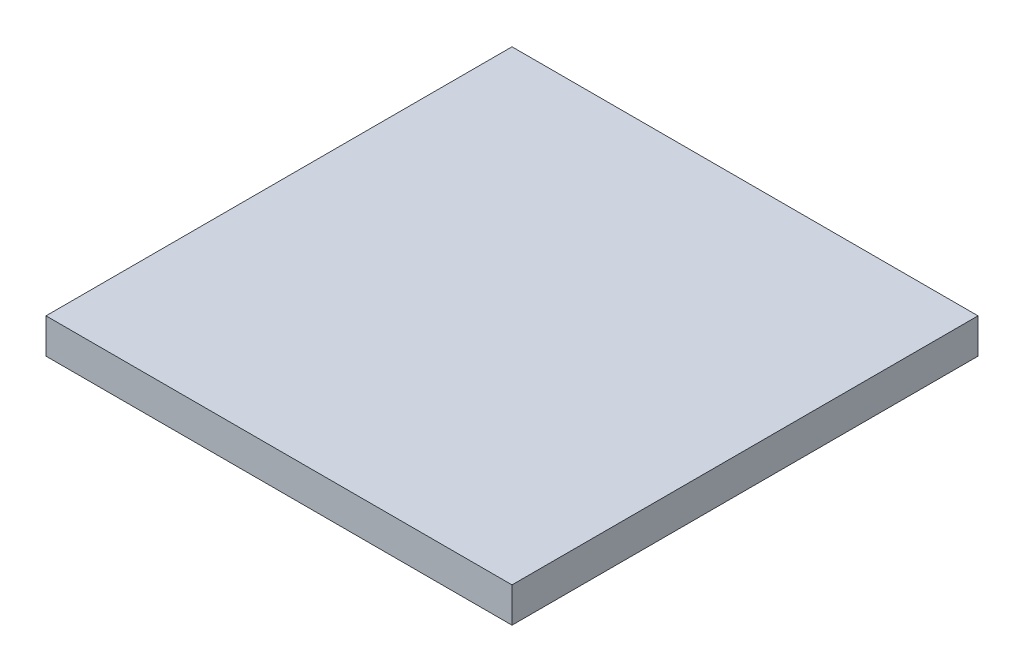
ISO-10303-21;
HEADER;
FILE_DESCRIPTION(('STEP AP214'),'2;1');
FILE_NAME('part.step','',(''),(''),'','','');
FILE_SCHEMA(('AUTOMOTIVE_DESIGN { 1 0 10303 214 1 1 1 1 }'));
ENDSEC;
DATA;
#1=APPLICATION_CONTEXT('core data for automotive mechanical design processes');
#2=APPLICATION_PROTOCOL_DEFINITION('international standard','automotive_design',2000,#1);
#3=PRODUCT_CONTEXT('',#1,'mechanical');
#4=PRODUCT('Part','Part','',(#3));
#5=PRODUCT_RELATED_PRODUCT_CATEGORY('part','',(#4));
#6=PRODUCT_DEFINITION_FORMATION('','',#4);
#7=PRODUCT_DEFINITION_CONTEXT('part definition',#1,'design');
#8=PRODUCT_DEFINITION('design','',#6,#7);
#9=PRODUCT_DEFINITION_SHAPE('','',#8);
#10=(LENGTH_UNIT() NAMED_UNIT(*) SI_UNIT(.MILLI.,.METRE.));
#11=(NAMED_UNIT(*) PLANE_ANGLE_UNIT() SI_UNIT($,.RADIAN.));
#12=(NAMED_UNIT(*) SI_UNIT($,.STERADIAN.) SOLID_ANGLE_UNIT());
#13=UNCERTAINTY_MEASURE_WITH_UNIT(LENGTH_MEASURE(1.E-05),#10,'distance_accuracy_value','');
#14=(GEOMETRIC_REPRESENTATION_CONTEXT(3) GLOBAL_UNCERTAINTY_ASSIGNED_CONTEXT((#13)) GLOBAL_UNIT_ASSIGNED_CONTEXT((#10,
#11,#12)) REPRESENTATION_CONTEXT('',''));
#15=CARTESIAN_POINT('',(0.,0.,0.));
#16=DIRECTION('',(0.,0.,1.));
#17=DIRECTION('',(1.,0.,0.));
#18=AXIS2_PLACEMENT_3D('',#15,#16,#17);
#19=CARTESIAN_POINT('',(-254.,-19.05,-508.));
#20=DIRECTION('',(-1.,0.,0.));
#21=DIRECTION('',(0.,0.,1.));
#22=AXIS2_PLACEMENT_3D('',#19,#20,#21);
#23=PLANE('',#22);
#24=DIRECTION('',(0.,-1.,0.));
#25=VECTOR('',#24,1.);
#26=CARTESIAN_POINT('',(-254.,-19.05,0.));
#27=LINE('',#26,#25);
#28=CARTESIAN_POINT('',(-254.,19.05,0.));
#29=VERTEX_POINT('',#28);
#30=CARTESIAN_POINT('',(-254.,-19.05,0.));
#31=VERTEX_POINT('',#30);
#32=EDGE_CURVE('E97',#29,#31,#27,.T.);
#33=ORIENTED_EDGE('',*,*,#32,.F.);
#34=DIRECTION('',(0.,0.,1.));
#35=VECTOR('',#34,1.);
#36=CARTESIAN_POINT('',(-254.,19.05,-508.));
#37=LINE('',#36,#35);
#38=CARTESIAN_POINT('',(-254.,19.05,-508.));
#39=VERTEX_POINT('',#38);
#40=EDGE_CURVE('E11',#39,#29,#37,.T.);
#41=ORIENTED_EDGE('',*,*,#40,.F.);
#42=DIRECTION('',(0.,-1.,0.));
#43=VECTOR('',#42,1.);
#44=CARTESIAN_POINT('',(-254.,-19.05,-508.));
#45=LINE('',#44,#43);
#46=CARTESIAN_POINT('',(-254.,-19.05,-508.));
#47=VERTEX_POINT('',#46);
#48=EDGE_CURVE('E91',#39,#47,#45,.T.);
#49=ORIENTED_EDGE('',*,*,#48,.T.);
#50=DIRECTION('',(0.,0.,1.));
#51=VECTOR('',#50,1.);
#52=CARTESIAN_POINT('',(-254.,-19.05,-508.));
#53=LINE('',#52,#51);
#54=EDGE_CURVE('E36',#47,#31,#53,.T.);
#55=ORIENTED_EDGE('',*,*,#54,.T.);
#56=EDGE_LOOP('',(#33,#41,#49,#55));
#57=FACE_BOUND('',#56,.T.);
#58=ADVANCED_FACE('F33',(#57),#23,.T.);
#59=CARTESIAN_POINT('',(254.,19.05,-508.));
#60=DIRECTION('',(0.,1.,0.));
#61=DIRECTION('',(-1.,0.,0.));
#62=AXIS2_PLACEMENT_3D('',#59,#60,#61);
#63=PLANE('',#62);
#64=DIRECTION('',(-1.,0.,0.));
#65=VECTOR('',#64,1.);
#66=CARTESIAN_POINT('',(254.,19.05,0.));
#67=LINE('',#66,#65);
#68=CARTESIAN_POINT('',(254.,19.05,0.));
#69=VERTEX_POINT('',#68);
#70=EDGE_CURVE('E93',#69,#29,#67,.T.);
#71=ORIENTED_EDGE('',*,*,#70,.F.);
#72=DIRECTION('',(0.,0.,1.));
#73=VECTOR('',#72,1.);
#74=CARTESIAN_POINT('',(254.,19.05,-508.));
#75=LINE('',#74,#73);
#76=CARTESIAN_POINT('',(254.,19.05,-508.));
#77=VERTEX_POINT('',#76);
#78=EDGE_CURVE('E42',#77,#69,#75,.T.);
#79=ORIENTED_EDGE('',*,*,#78,.F.);
#80=DIRECTION('',(-1.,0.,0.));
#81=VECTOR('',#80,1.);
#82=CARTESIAN_POINT('',(254.,19.05,-508.));
#83=LINE('',#82,#81);
#84=EDGE_CURVE('E88',#77,#39,#83,.T.);
#85=ORIENTED_EDGE('',*,*,#84,.T.);
#86=ORIENTED_EDGE('',*,*,#40,.T.);
#87=EDGE_LOOP('',(#71,#79,#85,#86));
#88=FACE_BOUND('',#87,.T.);
#89=ADVANCED_FACE('F107',(#88),#63,.T.);
#90=CARTESIAN_POINT('',(254.,-19.05,-508.));
#91=DIRECTION('',(1.,0.,0.));
#92=DIRECTION('',(0.,0.,-1.));
#93=AXIS2_PLACEMENT_3D('',#90,#91,#92);
#94=PLANE('',#93);
#95=DIRECTION('',(0.,1.,0.));
#96=VECTOR('',#95,1.);
#97=CARTESIAN_POINT('',(254.,-19.05,0.));
#98=LINE('',#97,#96);
#99=CARTESIAN_POINT('',(254.,-19.05,0.));
#100=VERTEX_POINT('',#99);
#101=EDGE_CURVE('E83',#100,#69,#98,.T.);
#102=ORIENTED_EDGE('',*,*,#101,.F.);
#103=DIRECTION('',(0.,0.,1.));
#104=VECTOR('',#103,1.);
#105=CARTESIAN_POINT('',(254.,-19.05,-508.));
#106=LINE('',#105,#104);
#107=CARTESIAN_POINT('',(254.,-19.05,-508.));
#108=VERTEX_POINT('',#107);
#109=EDGE_CURVE('E78',#108,#100,#106,.T.);
#110=ORIENTED_EDGE('',*,*,#109,.F.);
#111=DIRECTION('',(0.,1.,0.));
#112=VECTOR('',#111,1.);
#113=CARTESIAN_POINT('',(254.,-19.05,-508.));
#114=LINE('',#113,#112);
#115=EDGE_CURVE('E81',#108,#77,#114,.T.);
#116=ORIENTED_EDGE('',*,*,#115,.T.);
#117=ORIENTED_EDGE('',*,*,#78,.T.);
#118=EDGE_LOOP('',(#102,#110,#116,#117));
#119=FACE_BOUND('',#118,.T.);
#120=ADVANCED_FACE('F80',(#119),#94,.T.);
#121=CARTESIAN_POINT('',(254.,-19.05,-508.));
#122=DIRECTION('',(0.,-1.,0.));
#123=DIRECTION('',(1.,0.,0.));
#124=AXIS2_PLACEMENT_3D('',#121,#122,#123);
#125=PLANE('',#124);
#126=DIRECTION('',(1.,0.,0.));
#127=VECTOR('',#126,1.);
#128=CARTESIAN_POINT('',(254.,-19.05,0.));
#129=LINE('',#128,#127);
#130=EDGE_CURVE('E100',#31,#100,#129,.T.);
#131=ORIENTED_EDGE('',*,*,#130,.F.);
#132=ORIENTED_EDGE('',*,*,#54,.F.);
#133=DIRECTION('',(1.,0.,0.));
#134=VECTOR('',#133,1.);
#135=CARTESIAN_POINT('',(254.,-19.05,-508.));
#136=LINE('',#135,#134);
#137=EDGE_CURVE('E87',#47,#108,#136,.T.);
#138=ORIENTED_EDGE('',*,*,#137,.T.);
#139=ORIENTED_EDGE('',*,*,#109,.T.);
#140=EDGE_LOOP('',(#131,#132,#138,#139));
#141=FACE_BOUND('',#140,.T.);
#142=ADVANCED_FACE('F90',(#141),#125,.T.);
#143=CARTESIAN_POINT('',(0.,0.,-508.));
#144=DIRECTION('',(0.,0.,1.));
#145=DIRECTION('',(1.,0.,0.));
#146=AXIS2_PLACEMENT_3D('',#143,#144,#145);
#147=PLANE('',#146);
#148=ORIENTED_EDGE('',*,*,#48,.F.);
#149=ORIENTED_EDGE('',*,*,#84,.F.);
#150=ORIENTED_EDGE('',*,*,#115,.F.);
#151=ORIENTED_EDGE('',*,*,#137,.F.);
#152=EDGE_LOOP('',(#148,#149,#150,#151));
#153=FACE_BOUND('',#152,.T.);
#154=ADVANCED_FACE('F86',(#153),#147,.F.);
#155=CARTESIAN_POINT('',(0.,0.,0.));
#156=DIRECTION('',(0.,0.,1.));
#157=DIRECTION('',(1.,0.,0.));
#158=AXIS2_PLACEMENT_3D('',#155,#156,#157);
#159=PLANE('',#158);
#160=ORIENTED_EDGE('',*,*,#32,.T.);
#161=ORIENTED_EDGE('',*,*,#130,.T.);
#162=ORIENTED_EDGE('',*,*,#101,.T.);
#163=ORIENTED_EDGE('',*,*,#70,.T.);
#164=EDGE_LOOP('',(#160,#161,#162,#163));
#165=FACE_BOUND('',#164,.T.);
#166=ADVANCED_FACE('F106',(#165),#159,.T.);
#167=CLOSED_SHELL('',(#58,#89,#120,#142,#154,#166));
#168=MANIFOLD_SOLID_BREP('B2',#167);
#169=ADVANCED_BREP_SHAPE_REPRESENTATION('',(#18,#168),#14);
#170=SHAPE_DEFINITION_REPRESENTATION(#9,#169);
ENDSEC;
END-ISO-10303-21;
